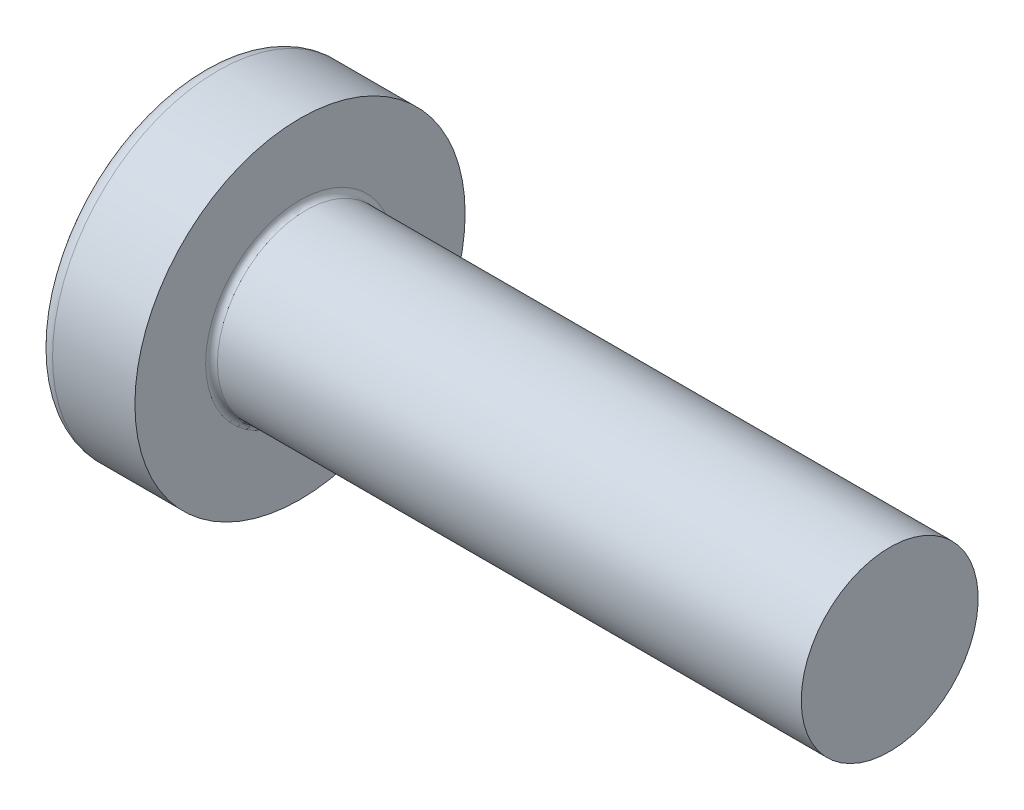
ISO-10303-21;
HEADER;
FILE_DESCRIPTION(('STEP AP214'),'2;1');
FILE_NAME('part.step','',(''),(''),'','','');
FILE_SCHEMA(('AUTOMOTIVE_DESIGN { 1 0 10303 214 1 1 1 1 }'));
ENDSEC;
DATA;
#1=APPLICATION_CONTEXT('core data for automotive mechanical design processes');
#2=APPLICATION_PROTOCOL_DEFINITION('international standard','automotive_design',2000,#1);
#3=PRODUCT_CONTEXT('',#1,'mechanical');
#4=PRODUCT('Part','Part','',(#3));
#5=PRODUCT_RELATED_PRODUCT_CATEGORY('part','',(#4));
#6=PRODUCT_DEFINITION_FORMATION('','',#4);
#7=PRODUCT_DEFINITION_CONTEXT('part definition',#1,'design');
#8=PRODUCT_DEFINITION('design','',#6,#7);
#9=PRODUCT_DEFINITION_SHAPE('','',#8);
#10=(LENGTH_UNIT() NAMED_UNIT(*) SI_UNIT(.MILLI.,.METRE.));
#11=(NAMED_UNIT(*) PLANE_ANGLE_UNIT() SI_UNIT($,.RADIAN.));
#12=(NAMED_UNIT(*) SI_UNIT($,.STERADIAN.) SOLID_ANGLE_UNIT());
#13=UNCERTAINTY_MEASURE_WITH_UNIT(LENGTH_MEASURE(1.E-05),#10,'distance_accuracy_value','');
#14=(GEOMETRIC_REPRESENTATION_CONTEXT(3) GLOBAL_UNCERTAINTY_ASSIGNED_CONTEXT((#13)) GLOBAL_UNIT_ASSIGNED_CONTEXT((#10,
#11,#12)) REPRESENTATION_CONTEXT('',''));
#15=CARTESIAN_POINT('',(0.,0.,0.));
#16=DIRECTION('',(0.,0.,1.));
#17=DIRECTION('',(1.,0.,0.));
#18=AXIS2_PLACEMENT_3D('',#15,#16,#17);
#19=CARTESIAN_POINT('',(5.,0.,0.));
#20=DIRECTION('',(-1.,0.,0.));
#21=DIRECTION('',(0.,1.,0.));
#22=AXIS2_PLACEMENT_3D('',#19,#20,#21);
#23=SPHERICAL_SURFACE('',#22,5.);
#24=CARTESIAN_POINT('',(0.775371598933733,0.,0.));
#25=DIRECTION('',(-1.,0.,0.));
#26=DIRECTION('',(0.,0.,1.));
#27=AXIS2_PLACEMENT_3D('',#24,#25,#26);
#28=CIRCLE('',#27,2.67441860465116);
#29=CARTESIAN_POINT('',(0.775371598933733,0.,2.67441860465116));
#30=VERTEX_POINT('',#29);
#31=EDGE_CURVE('E239',#30,#30,#28,.T.);
#32=ORIENTED_EDGE('',*,*,#31,.T.);
#33=EDGE_LOOP('',(#32));
#34=FACE_BOUND('',#33,.T.);
#35=CARTESIAN_POINT('',(0.0457951200896417,0.,0.));
#36=DIRECTION('',(1.,0.,0.));
#37=DIRECTION('',(0.,0.,-1.));
#38=AXIS2_PLACEMENT_3D('',#35,#36,#37);
#39=CIRCLE('',#38,0.675169614150692);
#40=CARTESIAN_POINT('',(0.0457951200896426,-0.369999999999998,-0.564760133040918));
#41=VERTEX_POINT('',#40);
#42=CARTESIAN_POINT('',(0.0457951200896417,-0.564760133040916,-0.37));
#43=VERTEX_POINT('',#42);
#44=EDGE_CURVE('E375',#41,#43,#39,.F.);
#45=ORIENTED_EDGE('',*,*,#44,.F.);
#46=CARTESIAN_POINT('',(5.,-0.37,0.));
#47=DIRECTION('',(0.,1.,0.));
#48=DIRECTION('',(0.,0.,1.));
#49=AXIS2_PLACEMENT_3D('',#46,#47,#48);
#50=CIRCLE('',#49,4.98629120689917);
#51=CARTESIAN_POINT('',(0.187869734228639,-0.369999999999995,-1.30633162146802));
#52=VERTEX_POINT('',#51);
#53=EDGE_CURVE('E301',#52,#41,#50,.T.);
#54=ORIENTED_EDGE('',*,*,#53,.F.);
#55=CARTESIAN_POINT('',(4.56358262530798,0.,0.875317983305919));
#56=DIRECTION('',(0.446197753347436,0.,-0.894934391398443));
#57=DIRECTION('',(-0.894934391398443,0.,-0.446197753347436));
#58=AXIS2_PLACEMENT_3D('',#55,#56,#57);
#59=CIRCLE('',#58,4.90340272700175);
#60=CARTESIAN_POINT('',(0.18786973422864,0.370000000000005,-1.30633162146802));
#61=VERTEX_POINT('',#60);
#62=EDGE_CURVE('E273',#52,#61,#59,.T.);
#63=ORIENTED_EDGE('',*,*,#62,.T.);
#64=CARTESIAN_POINT('',(5.,0.37,0.));
#65=DIRECTION('',(0.,-1.,0.));
#66=DIRECTION('',(0.,0.,-1.));
#67=AXIS2_PLACEMENT_3D('',#64,#65,#66);
#68=CIRCLE('',#67,4.98629120689917);
#69=CARTESIAN_POINT('',(0.0457951200896425,0.370000000000002,-0.564760133040916));
#70=VERTEX_POINT('',#69);
#71=EDGE_CURVE('E328',#70,#61,#68,.T.);
#72=ORIENTED_EDGE('',*,*,#71,.F.);
#73=CARTESIAN_POINT('',(0.0457951200896417,0.564760133040915,-0.37));
#74=VERTEX_POINT('',#73);
#75=EDGE_CURVE('E394',#74,#70,#39,.F.);
#76=ORIENTED_EDGE('',*,*,#75,.F.);
#77=CARTESIAN_POINT('',(5.,0.,-0.37));
#78=DIRECTION('',(0.,0.,1.));
#79=DIRECTION('',(1.,0.,0.));
#80=AXIS2_PLACEMENT_3D('',#77,#78,#79);
#81=CIRCLE('',#80,4.98629120689917);
#82=CARTESIAN_POINT('',(0.187869734228641,1.30633162146802,-0.37));
#83=VERTEX_POINT('',#82);
#84=EDGE_CURVE('E267',#83,#74,#81,.T.);
#85=ORIENTED_EDGE('',*,*,#84,.F.);
#86=CARTESIAN_POINT('',(4.56358262530798,-0.87531798330592,0.));
#87=DIRECTION('',(0.446197753347436,0.894934391398443,0.));
#88=DIRECTION('',(-0.894934391398442,0.446197753347436,0.));
#89=AXIS2_PLACEMENT_3D('',#86,#87,#88);
#90=CIRCLE('',#89,4.90340272700175);
#91=CARTESIAN_POINT('',(0.18786973422864,1.30633162146802,0.37));
#92=VERTEX_POINT('',#91);
#93=EDGE_CURVE('E270',#83,#92,#90,.T.);
#94=ORIENTED_EDGE('',*,*,#93,.T.);
#95=CARTESIAN_POINT('',(5.,0.,0.37));
#96=DIRECTION('',(0.,0.,-1.));
#97=DIRECTION('',(0.,1.,0.));
#98=AXIS2_PLACEMENT_3D('',#95,#96,#97);
#99=CIRCLE('',#98,4.98629120689917);
#100=CARTESIAN_POINT('',(0.0457951200896417,0.564760133040915,0.37));
#101=VERTEX_POINT('',#100);
#102=EDGE_CURVE('E263',#101,#92,#99,.T.);
#103=ORIENTED_EDGE('',*,*,#102,.F.);
#104=CARTESIAN_POINT('',(0.0457951200896434,0.369999999999998,0.564760133040918));
#105=VERTEX_POINT('',#104);
#106=EDGE_CURVE('E393',#105,#101,#39,.F.);
#107=ORIENTED_EDGE('',*,*,#106,.F.);
#108=CARTESIAN_POINT('',(0.18786973422864,0.369999999999995,1.30633162146802));
#109=VERTEX_POINT('',#108);
#110=EDGE_CURVE('E283',#109,#105,#68,.T.);
#111=ORIENTED_EDGE('',*,*,#110,.F.);
#112=CARTESIAN_POINT('',(4.56358262530798,0.,-0.87531798330592));
#113=DIRECTION('',(0.446197753347436,0.,0.894934391398443));
#114=DIRECTION('',(0.894934391398442,0.,-0.446197753347436));
#115=AXIS2_PLACEMENT_3D('',#112,#113,#114);
#116=CIRCLE('',#115,4.90340272700175);
#117=CARTESIAN_POINT('',(0.18786973422864,-0.370000000000005,1.30633162146802));
#118=VERTEX_POINT('',#117);
#119=EDGE_CURVE('E50',#109,#118,#116,.T.);
#120=ORIENTED_EDGE('',*,*,#119,.T.);
#121=CARTESIAN_POINT('',(0.0457951200896421,-0.370000000000002,0.564760133040916));
#122=VERTEX_POINT('',#121);
#123=EDGE_CURVE('E280',#122,#118,#50,.T.);
#124=ORIENTED_EDGE('',*,*,#123,.F.);
#125=CARTESIAN_POINT('',(0.0457951200896417,-0.564760133040916,0.37));
#126=VERTEX_POINT('',#125);
#127=EDGE_CURVE('E433',#126,#122,#39,.F.);
#128=ORIENTED_EDGE('',*,*,#127,.F.);
#129=CARTESIAN_POINT('',(0.187869734228639,-1.30633162146802,0.37));
#130=VERTEX_POINT('',#129);
#131=EDGE_CURVE('E264',#130,#126,#99,.T.);
#132=ORIENTED_EDGE('',*,*,#131,.F.);
#133=CARTESIAN_POINT('',(4.56358262530798,0.875317983305919,0.));
#134=DIRECTION('',(0.446197753347436,-0.894934391398443,0.));
#135=DIRECTION('',(0.894934391398443,0.446197753347436,0.));
#136=AXIS2_PLACEMENT_3D('',#133,#134,#135);
#137=CIRCLE('',#136,4.90340272700175);
#138=CARTESIAN_POINT('',(0.18786973422864,-1.30633162146802,-0.37));
#139=VERTEX_POINT('',#138);
#140=EDGE_CURVE('E260',#130,#139,#137,.T.);
#141=ORIENTED_EDGE('',*,*,#140,.T.);
#142=EDGE_CURVE('E65',#43,#139,#81,.T.);
#143=ORIENTED_EDGE('',*,*,#142,.F.);
#144=EDGE_LOOP('',(#45,#54,#63,#72,#76,#85,#94,#103,#107,#111,#120,#124,#128,#132,#141,#143));
#145=FACE_BOUND('',#144,.T.);
#146=ADVANCED_FACE('F36',(#34,#145),#23,.T.);
#147=CARTESIAN_POINT('',(1.75,0.527482331818931,-0.37));
#148=DIRECTION('',(0.,0.,1.));
#149=DIRECTION('',(1.,0.,0.));
#150=AXIS2_PLACEMENT_3D('',#147,#148,#149);
#151=PLANE('',#150);
#152=ORIENTED_EDGE('',*,*,#84,.T.);
#153=CARTESIAN_POINT('',(-0.987293237053716,0.649401255967161,-0.37));
#154=CARTESIAN_POINT('',(-0.781914975317084,0.632865887002871,-0.37));
#155=CARTESIAN_POINT('',(-0.576547882393372,0.616188977635081,-0.37));
#156=CARTESIAN_POINT('',(-0.165841599226327,0.582441031964227,-0.37));
#157=CARTESIAN_POINT('',(0.0394975903090452,0.56536998705488,-0.37));
#158=CARTESIAN_POINT('',(0.450133475422572,0.530723441326535,-0.37));
#159=CARTESIAN_POINT('',(0.655430171010573,0.513147940624557,-0.37));
#160=CARTESIAN_POINT('',(1.06596140177934,0.477314957985794,-0.37));
#161=CARTESIAN_POINT('',(1.2711959378071,0.459057485806066,-0.37));
#162=CARTESIAN_POINT('',(1.61065292365626,0.428051938688768,-0.37));
#163=CARTESIAN_POINT('',(1.74490059995643,0.415580824990931,-0.37));
#164=CARTESIAN_POINT('',(2.01334321762763,0.390092023404979,-0.37));
#165=CARTESIAN_POINT('',(2.14753815934577,0.377074339177353,-0.37));
#166=CARTESIAN_POINT('',(2.41586354151957,0.350315629452843,-0.37));
#167=CARTESIAN_POINT('',(2.5499939784531,0.33657456817765,-0.37));
#168=CARTESIAN_POINT('',(2.81814173295471,0.308004077741875,-0.37));
#169=CARTESIAN_POINT('',(2.95215904765134,0.293174621747065,-0.37));
#170=CARTESIAN_POINT('',(3.0860955068368,0.277618485071816,-0.37));
#171=B_SPLINE_CURVE_WITH_KNOTS('',3,(#153,#154,#155,#156,#157,#158,#159,#160,#161,#162,#163,
#164,#165,#166,#167,#168,#169,#170),.UNSPECIFIED.,.F.,.F.,(4,2,2,2,2,2,2,2,4),(0.,
0.618128793984691,1.23627109812525,1.85441325887562,2.4725465791681,2.87702276218609,
3.28149623678161,3.68598973550942,4.09049321032311),.UNSPECIFIED.);
#172=CARTESIAN_POINT('',(1.75,0.415013252800437,-0.370000000000001));
#173=VERTEX_POINT('',#172);
#174=EDGE_CURVE('E417',#74,#173,#171,.T.);
#175=ORIENTED_EDGE('',*,*,#174,.T.);
#176=DIRECTION('',(0.,1.,0.));
#177=VECTOR('',#176,1.);
#178=CARTESIAN_POINT('',(1.75,-0.527482331818931,-0.37));
#179=LINE('',#178,#177);
#180=CARTESIAN_POINT('',(1.75,0.527482331818931,-0.37));
#181=VERTEX_POINT('',#180);
#182=EDGE_CURVE('E357',#173,#181,#179,.T.);
#183=ORIENTED_EDGE('',*,*,#182,.T.);
#184=DIRECTION('',(0.894934391398442,-0.446197753347436,0.));
#185=VECTOR('',#184,1.);
#186=CARTESIAN_POINT('',(0.,1.4,-0.37));
#187=LINE('',#186,#185);
#188=EDGE_CURVE('E240',#83,#181,#187,.T.);
#189=ORIENTED_EDGE('',*,*,#188,.F.);
#190=EDGE_LOOP('',(#152,#175,#183,#189));
#191=FACE_BOUND('',#190,.T.);
#192=ADVANCED_FACE('F195',(#191),#151,.T.);
#193=CARTESIAN_POINT('',(1.75,-0.527482331818931,-0.37));
#194=VERTEX_POINT('',#193);
#195=CARTESIAN_POINT('',(1.75,-0.415013252800437,-0.370000000000001));
#196=VERTEX_POINT('',#195);
#197=EDGE_CURVE('E248',#194,#196,#179,.T.);
#198=ORIENTED_EDGE('',*,*,#197,.T.);
#199=CARTESIAN_POINT('',(-0.987293237053716,-0.649401255967161,-0.37));
#200=CARTESIAN_POINT('',(-0.781914975317084,-0.632865887002871,-0.37));
#201=CARTESIAN_POINT('',(-0.576547882393372,-0.616188977635081,-0.37));
#202=CARTESIAN_POINT('',(-0.165841599226327,-0.582441031964227,-0.37));
#203=CARTESIAN_POINT('',(0.0394975903090452,-0.56536998705488,-0.37));
#204=CARTESIAN_POINT('',(0.450133475422572,-0.530723441326535,-0.37));
#205=CARTESIAN_POINT('',(0.655430171010573,-0.513147940624557,-0.37));
#206=CARTESIAN_POINT('',(1.06596140177934,-0.477314957985794,-0.37));
#207=CARTESIAN_POINT('',(1.2711959378071,-0.459057485806066,-0.37));
#208=CARTESIAN_POINT('',(1.61065292365626,-0.428051938688768,-0.37));
#209=CARTESIAN_POINT('',(1.74490059995643,-0.415580824990931,-0.37));
#210=CARTESIAN_POINT('',(2.01334321762763,-0.390092023404979,-0.37));
#211=CARTESIAN_POINT('',(2.14753815934577,-0.377074339177353,-0.37));
#212=CARTESIAN_POINT('',(2.41586354151957,-0.350315629452843,-0.37));
#213=CARTESIAN_POINT('',(2.5499939784531,-0.33657456817765,-0.37));
#214=CARTESIAN_POINT('',(2.81814173295471,-0.308004077741875,-0.37));
#215=CARTESIAN_POINT('',(2.95215904765134,-0.293174621747065,-0.37));
#216=CARTESIAN_POINT('',(3.0860955068368,-0.277618485071816,-0.37));
#217=B_SPLINE_CURVE_WITH_KNOTS('',3,(#199,#200,#201,#202,#203,#204,#205,#206,#207,#208,#209,
#210,#211,#212,#213,#214,#215,#216),.UNSPECIFIED.,.F.,.F.,(4,2,2,2,2,2,2,2,4),(0.,
0.618128793984691,1.23627109812525,1.85441325887562,2.4725465791681,2.87702276218609,
3.28149623678161,3.68598973550942,4.09049321032311),.UNSPECIFIED.);
#218=EDGE_CURVE('E392',#196,#43,#217,.F.);
#219=ORIENTED_EDGE('',*,*,#218,.T.);
#220=ORIENTED_EDGE('',*,*,#142,.T.);
#221=DIRECTION('',(0.894934391398442,0.446197753347436,0.));
#222=VECTOR('',#221,1.);
#223=CARTESIAN_POINT('',(0.,-1.4,-0.37));
#224=LINE('',#223,#222);
#225=EDGE_CURVE('E331',#139,#194,#224,.T.);
#226=ORIENTED_EDGE('',*,*,#225,.T.);
#227=EDGE_LOOP('',(#198,#219,#220,#226));
#228=FACE_BOUND('',#227,.T.);
#229=ADVANCED_FACE('F201',(#228),#151,.T.);
#230=CARTESIAN_POINT('',(1.75,-0.527482331818931,0.37));
#231=DIRECTION('',(0.,0.,-1.));
#232=DIRECTION('',(0.,1.,0.));
#233=AXIS2_PLACEMENT_3D('',#230,#231,#232);
#234=PLANE('',#233);
#235=DIRECTION('',(0.,-1.,0.));
#236=VECTOR('',#235,1.);
#237=CARTESIAN_POINT('',(1.75,0.527482331818931,0.37));
#238=LINE('',#237,#236);
#239=CARTESIAN_POINT('',(1.75,0.527482331818931,0.37));
#240=VERTEX_POINT('',#239);
#241=CARTESIAN_POINT('',(1.75,0.415013252800437,0.370000000000001));
#242=VERTEX_POINT('',#241);
#243=EDGE_CURVE('E340',#240,#242,#238,.T.);
#244=ORIENTED_EDGE('',*,*,#243,.T.);
#245=CARTESIAN_POINT('',(-0.987293237053716,0.649401255967161,0.37));
#246=CARTESIAN_POINT('',(-0.781914975317084,0.632865887002871,0.37));
#247=CARTESIAN_POINT('',(-0.576547882393372,0.616188977635081,0.37));
#248=CARTESIAN_POINT('',(-0.165841599226327,0.582441031964227,0.37));
#249=CARTESIAN_POINT('',(0.0394975903090453,0.56536998705488,0.37));
#250=CARTESIAN_POINT('',(0.450133475422572,0.530723441326535,0.37));
#251=CARTESIAN_POINT('',(0.655430171010574,0.513147940624557,0.37));
#252=CARTESIAN_POINT('',(1.06596140177934,0.477314957985794,0.37));
#253=CARTESIAN_POINT('',(1.2711959378071,0.459057485806066,0.37));
#254=CARTESIAN_POINT('',(1.61065292365626,0.428051938688768,0.37));
#255=CARTESIAN_POINT('',(1.74490059995643,0.415580824990931,0.37));
#256=CARTESIAN_POINT('',(2.01334321762763,0.39009202340498,0.37));
#257=CARTESIAN_POINT('',(2.14753815934577,0.377074339177353,0.37));
#258=CARTESIAN_POINT('',(2.41586354151957,0.350315629452843,0.37));
#259=CARTESIAN_POINT('',(2.5499939784531,0.33657456817765,0.37));
#260=CARTESIAN_POINT('',(2.81814173295471,0.308004077741875,0.37));
#261=CARTESIAN_POINT('',(2.95215904765134,0.293174621747065,0.37));
#262=CARTESIAN_POINT('',(3.0860955068368,0.277618485071816,0.37));
#263=B_SPLINE_CURVE_WITH_KNOTS('',3,(#245,#246,#247,#248,#249,#250,#251,#252,#253,#254,#255,
#256,#257,#258,#259,#260,#261,#262),.UNSPECIFIED.,.F.,.F.,(4,2,2,2,2,2,2,2,4),(0.,
0.618128793984691,1.23627109812525,1.85441325887562,2.4725465791681,2.87702276218609,
3.28149623678161,3.68598973550942,4.09049321032311),.UNSPECIFIED.);
#264=EDGE_CURVE('E672',#242,#101,#263,.F.);
#265=ORIENTED_EDGE('',*,*,#264,.T.);
#266=ORIENTED_EDGE('',*,*,#102,.T.);
#267=DIRECTION('',(0.894934391398442,-0.446197753347436,0.));
#268=VECTOR('',#267,1.);
#269=CARTESIAN_POINT('',(0.,1.4,0.37));
#270=LINE('',#269,#268);
#271=EDGE_CURVE('E245',#92,#240,#270,.T.);
#272=ORIENTED_EDGE('',*,*,#271,.T.);
#273=EDGE_LOOP('',(#244,#265,#266,#272));
#274=FACE_BOUND('',#273,.T.);
#275=ADVANCED_FACE('F413',(#274),#234,.T.);
#276=ORIENTED_EDGE('',*,*,#131,.T.);
#277=CARTESIAN_POINT('',(-0.987293237069635,-0.649401255968442,0.37));
#278=CARTESIAN_POINT('',(-0.781914975331301,-0.632865887004023,0.37));
#279=CARTESIAN_POINT('',(-0.576547882405888,-0.616188977636102,0.37));
#280=CARTESIAN_POINT('',(-0.16584159923544,-0.582441031964983,0.37));
#281=CARTESIAN_POINT('',(0.0394975903016338,-0.5653699870555,0.37));
#282=CARTESIAN_POINT('',(0.450133475420601,-0.530723441326706,0.37));
#283=CARTESIAN_POINT('',(0.655430171012341,-0.513147940624409,0.37));
#284=CARTESIAN_POINT('',(1.06596140178858,-0.477314957984981,0.37));
#285=CARTESIAN_POINT('',(1.27119593782008,-0.459057485804908,0.37));
#286=CARTESIAN_POINT('',(1.61065292367297,-0.428051938687225,0.37));
#287=CARTESIAN_POINT('',(1.74490059997313,-0.415580824989368,0.37));
#288=CARTESIAN_POINT('',(2.01334321764434,-0.390092023403371,0.37));
#289=CARTESIAN_POINT('',(2.14753815936247,-0.377074339175718,0.37));
#290=CARTESIAN_POINT('',(2.41586354153627,-0.350315629451146,0.37));
#291=CARTESIAN_POINT('',(2.54999397846979,-0.336574568175918,0.37));
#292=CARTESIAN_POINT('',(2.8181417329714,-0.308004077740054,0.37));
#293=CARTESIAN_POINT('',(2.95215904766802,-0.29317462174519,0.37));
#294=CARTESIAN_POINT('',(3.08609550685347,-0.277618485069873,0.37));
#295=B_SPLINE_CURVE_WITH_KNOTS('',3,(#277,#278,#279,#280,#281,#282,#283,#284,#285,#286,#287,
#288,#289,#290,#291,#292,#293,#294),.UNSPECIFIED.,.F.,.F.,(4,2,2,2,2,2,2,2,4),(0.,
0.61812879398981,1.23627109813549,1.85441325889711,2.47254657920086,2.87702276221884,
3.28149623681437,3.68598973554218,4.09049321035586),.UNSPECIFIED.);
#296=CARTESIAN_POINT('',(1.75,-0.415013252800437,0.37));
#297=VERTEX_POINT('',#296);
#298=EDGE_CURVE('E434',#126,#297,#295,.T.);
#299=ORIENTED_EDGE('',*,*,#298,.T.);
#300=CARTESIAN_POINT('',(1.75,-0.527482331818932,0.37));
#301=VERTEX_POINT('',#300);
#302=EDGE_CURVE('E342',#297,#301,#238,.T.);
#303=ORIENTED_EDGE('',*,*,#302,.T.);
#304=DIRECTION('',(0.894934391398443,0.446197753347436,0.));
#305=VECTOR('',#304,1.);
#306=CARTESIAN_POINT('',(0.,-1.4,0.37));
#307=LINE('',#306,#305);
#308=EDGE_CURVE('E333',#130,#301,#307,.T.);
#309=ORIENTED_EDGE('',*,*,#308,.F.);
#310=EDGE_LOOP('',(#276,#299,#303,#309));
#311=FACE_BOUND('',#310,.T.);
#312=ADVANCED_FACE('F520',(#311),#234,.T.);
#313=CARTESIAN_POINT('',(1.75,0.527482331818931,0.37));
#314=DIRECTION('',(0.446197753347436,0.894934391398443,0.));
#315=DIRECTION('',(-0.894934391398442,0.446197753347436,0.));
#316=AXIS2_PLACEMENT_3D('',#313,#314,#315);
#317=PLANE('',#316);
#318=CARTESIAN_POINT('',(2.6696526882832,0.0689604923233249,0.));
#319=DIRECTION('',(0.446197753347436,0.894934391398443,0.));
#320=DIRECTION('',(-0.894934391398443,0.446197753347436,0.));
#321=AXIS2_PLACEMENT_3D('',#318,#319,#320);
#322=ELLIPSE('',#321,1.10195897609154,0.486831694838766);
#323=CARTESIAN_POINT('',(1.75,0.527482331818932,0.175779377683682));
#324=VERTEX_POINT('',#323);
#325=CARTESIAN_POINT('',(1.75,0.527482331818932,-0.175779377683682));
#326=VERTEX_POINT('',#325);
#327=EDGE_CURVE('E306',#324,#326,#322,.F.);
#328=ORIENTED_EDGE('',*,*,#327,.F.);
#329=DIRECTION('',(0.,0.,-1.));
#330=VECTOR('',#329,1.);
#331=CARTESIAN_POINT('',(1.75,0.527482331818931,0.37));
#332=LINE('',#331,#330);
#333=EDGE_CURVE('E343',#240,#324,#332,.T.);
#334=ORIENTED_EDGE('',*,*,#333,.F.);
#335=ORIENTED_EDGE('',*,*,#271,.F.);
#336=ORIENTED_EDGE('',*,*,#93,.F.);
#337=ORIENTED_EDGE('',*,*,#188,.T.);
#338=EDGE_CURVE('E345',#326,#181,#332,.T.);
#339=ORIENTED_EDGE('',*,*,#338,.F.);
#340=EDGE_LOOP('',(#328,#334,#335,#336,#337,#339));
#341=FACE_BOUND('',#340,.T.);
#342=ADVANCED_FACE('F411',(#341),#317,.F.);
#343=CARTESIAN_POINT('',(0.,-1.4,-0.37));
#344=DIRECTION('',(0.446197753347436,-0.894934391398443,0.));
#345=DIRECTION('',(0.894934391398443,0.446197753347436,0.));
#346=AXIS2_PLACEMENT_3D('',#343,#344,#345);
#347=PLANE('',#346);
#348=CARTESIAN_POINT('',(2.6696526882832,-0.0689604923233252,0.));
#349=DIRECTION('',(0.446197753347436,-0.894934391398443,0.));
#350=DIRECTION('',(-0.894934391398443,-0.446197753347436,0.));
#351=AXIS2_PLACEMENT_3D('',#348,#349,#350);
#352=ELLIPSE('',#351,1.10195897609154,0.486831694838766);
#353=CARTESIAN_POINT('',(1.75,-0.527482331818932,-0.175779377683681));
#354=VERTEX_POINT('',#353);
#355=CARTESIAN_POINT('',(1.75,-0.527482331818932,0.17577937768368));
#356=VERTEX_POINT('',#355);
#357=EDGE_CURVE('E674',#354,#356,#352,.F.);
#358=ORIENTED_EDGE('',*,*,#357,.F.);
#359=DIRECTION('',(0.,0.,1.));
#360=VECTOR('',#359,1.);
#361=CARTESIAN_POINT('',(1.75,-0.527482331818931,-0.37));
#362=LINE('',#361,#360);
#363=EDGE_CURVE('E336',#194,#354,#362,.T.);
#364=ORIENTED_EDGE('',*,*,#363,.F.);
#365=ORIENTED_EDGE('',*,*,#225,.F.);
#366=ORIENTED_EDGE('',*,*,#140,.F.);
#367=ORIENTED_EDGE('',*,*,#308,.T.);
#368=EDGE_CURVE('E339',#356,#301,#362,.T.);
#369=ORIENTED_EDGE('',*,*,#368,.F.);
#370=EDGE_LOOP('',(#358,#364,#365,#366,#367,#369));
#371=FACE_BOUND('',#370,.T.);
#372=ADVANCED_FACE('F507',(#371),#347,.F.);
#373=CARTESIAN_POINT('',(1.75,0.527482331818931,-0.37));
#374=DIRECTION('',(-1.,0.,0.));
#375=DIRECTION('',(0.,0.,1.));
#376=AXIS2_PLACEMENT_3D('',#373,#374,#375);
#377=PLANE('',#376);
#378=DIRECTION('',(0.,1.,0.));
#379=VECTOR('',#378,1.);
#380=CARTESIAN_POINT('',(1.75,-0.370000000000002,0.52748233181893));
#381=LINE('',#380,#379);
#382=CARTESIAN_POINT('',(1.75,-0.370000000000002,0.52748233181893));
#383=VERTEX_POINT('',#382);
#384=CARTESIAN_POINT('',(1.75,-0.175779377683686,0.52748233181893));
#385=VERTEX_POINT('',#384);
#386=EDGE_CURVE('E321',#383,#385,#381,.T.);
#387=ORIENTED_EDGE('',*,*,#386,.T.);
#388=CARTESIAN_POINT('',(1.75,0.,0.));
#389=DIRECTION('',(-1.,0.,0.));
#390=DIRECTION('',(0.,0.,1.));
#391=AXIS2_PLACEMENT_3D('',#388,#389,#390);
#392=CIRCLE('',#391,0.556);
#393=CARTESIAN_POINT('',(1.75,-0.370000000000001,0.415013252800436));
#394=VERTEX_POINT('',#393);
#395=EDGE_CURVE('E702',#394,#385,#392,.T.);
#396=ORIENTED_EDGE('',*,*,#395,.F.);
#397=DIRECTION('',(0.,0.,-1.));
#398=VECTOR('',#397,1.);
#399=CARTESIAN_POINT('',(1.75,-0.370000000000002,0.52748233181893));
#400=LINE('',#399,#398);
#401=EDGE_CURVE('E317',#383,#394,#400,.T.);
#402=ORIENTED_EDGE('',*,*,#401,.F.);
#403=EDGE_LOOP('',(#387,#396,#402));
#404=FACE_BOUND('',#403,.T.);
#405=ADVANCED_FACE('F500',(#404),#377,.T.);
#406=ORIENTED_EDGE('',*,*,#302,.F.);
#407=EDGE_CURVE('E707',#356,#297,#392,.T.);
#408=ORIENTED_EDGE('',*,*,#407,.F.);
#409=ORIENTED_EDGE('',*,*,#368,.T.);
#410=EDGE_LOOP('',(#406,#408,#409));
#411=FACE_BOUND('',#410,.T.);
#412=ADVANCED_FACE('F493',(#411),#377,.T.);
#413=ORIENTED_EDGE('',*,*,#363,.T.);
#414=EDGE_CURVE('E386',#196,#354,#392,.T.);
#415=ORIENTED_EDGE('',*,*,#414,.F.);
#416=ORIENTED_EDGE('',*,*,#197,.F.);
#417=EDGE_LOOP('',(#413,#415,#416));
#418=FACE_BOUND('',#417,.T.);
#419=ADVANCED_FACE('F487',(#418),#377,.T.);
#420=CARTESIAN_POINT('',(1.75,-0.369999999999998,-0.415013252800438));
#421=VERTEX_POINT('',#420);
#422=CARTESIAN_POINT('',(1.75,-0.369999999999998,-0.527482331818933));
#423=VERTEX_POINT('',#422);
#424=EDGE_CURVE('E320',#421,#423,#400,.T.);
#425=ORIENTED_EDGE('',*,*,#424,.F.);
#426=CARTESIAN_POINT('',(1.75,-0.17577937768368,-0.527482331818932));
#427=VERTEX_POINT('',#426);
#428=EDGE_CURVE('E57',#427,#421,#392,.T.);
#429=ORIENTED_EDGE('',*,*,#428,.F.);
#430=DIRECTION('',(0.,-1.,0.));
#431=VECTOR('',#430,1.);
#432=CARTESIAN_POINT('',(1.75,0.370000000000002,-0.52748233181893));
#433=LINE('',#432,#431);
#434=EDGE_CURVE('E316',#427,#423,#433,.T.);
#435=ORIENTED_EDGE('',*,*,#434,.T.);
#436=EDGE_LOOP('',(#425,#429,#435));
#437=FACE_BOUND('',#436,.T.);
#438=ADVANCED_FACE('F381',(#437),#377,.T.);
#439=CARTESIAN_POINT('',(1.75,0.370000000000002,-0.52748233181893));
#440=VERTEX_POINT('',#439);
#441=CARTESIAN_POINT('',(1.75,0.175779377683684,-0.527482331818931));
#442=VERTEX_POINT('',#441);
#443=EDGE_CURVE('E313',#440,#442,#433,.T.);
#444=ORIENTED_EDGE('',*,*,#443,.T.);
#445=CARTESIAN_POINT('',(1.75,0.370000000000001,-0.415013252800436));
#446=VERTEX_POINT('',#445);
#447=EDGE_CURVE('E385',#446,#442,#392,.T.);
#448=ORIENTED_EDGE('',*,*,#447,.F.);
#449=DIRECTION('',(0.,0.,1.));
#450=VECTOR('',#449,1.);
#451=CARTESIAN_POINT('',(1.75,0.370000000000002,-0.52748233181893));
#452=LINE('',#451,#450);
#453=EDGE_CURVE('E325',#440,#446,#452,.T.);
#454=ORIENTED_EDGE('',*,*,#453,.F.);
#455=EDGE_LOOP('',(#444,#448,#454));
#456=FACE_BOUND('',#455,.T.);
#457=ADVANCED_FACE('F475',(#456),#377,.T.);
#458=ORIENTED_EDGE('',*,*,#182,.F.);
#459=EDGE_CURVE('E691',#326,#173,#392,.T.);
#460=ORIENTED_EDGE('',*,*,#459,.F.);
#461=ORIENTED_EDGE('',*,*,#338,.T.);
#462=EDGE_LOOP('',(#458,#460,#461));
#463=FACE_BOUND('',#462,.T.);
#464=ADVANCED_FACE('F468',(#463),#377,.T.);
#465=ORIENTED_EDGE('',*,*,#333,.T.);
#466=EDGE_CURVE('E693',#242,#324,#392,.T.);
#467=ORIENTED_EDGE('',*,*,#466,.F.);
#468=ORIENTED_EDGE('',*,*,#243,.F.);
#469=EDGE_LOOP('',(#465,#467,#468));
#470=FACE_BOUND('',#469,.T.);
#471=ADVANCED_FACE('F462',(#470),#377,.T.);
#472=CARTESIAN_POINT('',(1.75,0.369999999999998,0.527482331818932));
#473=DIRECTION('',(0.,-1.,0.));
#474=DIRECTION('',(1.,0.,0.));
#475=AXIS2_PLACEMENT_3D('',#472,#473,#474);
#476=PLANE('',#475);
#477=ORIENTED_EDGE('',*,*,#110,.T.);
#478=CARTESIAN_POINT('',(-0.987293237069635,0.369999999999998,0.649401255968443));
#479=CARTESIAN_POINT('',(-0.781914975331301,0.369999999999998,0.632865887004024));
#480=CARTESIAN_POINT('',(-0.576547882405888,0.369999999999998,0.616188977636103));
#481=CARTESIAN_POINT('',(-0.16584159923544,0.369999999999998,0.582441031964984));
#482=CARTESIAN_POINT('',(0.0394975903016338,0.369999999999998,0.565369987055501));
#483=CARTESIAN_POINT('',(0.450133475420601,0.369999999999998,0.530723441326707));
#484=CARTESIAN_POINT('',(0.655430171012341,0.369999999999998,0.51314794062441));
#485=CARTESIAN_POINT('',(1.06596140178858,0.369999999999998,0.477314957984982));
#486=CARTESIAN_POINT('',(1.27119593782008,0.369999999999998,0.459057485804909));
#487=CARTESIAN_POINT('',(1.61065292367297,0.369999999999999,0.428051938687226));
#488=CARTESIAN_POINT('',(1.74490059997313,0.369999999999999,0.415580824989369));
#489=CARTESIAN_POINT('',(2.01334321764434,0.369999999999999,0.390092023403372));
#490=CARTESIAN_POINT('',(2.14753815936247,0.369999999999999,0.37707433917572));
#491=CARTESIAN_POINT('',(2.41586354153627,0.369999999999999,0.350315629451147));
#492=CARTESIAN_POINT('',(2.54999397846979,0.369999999999999,0.336574568175919));
#493=CARTESIAN_POINT('',(2.8181417329714,0.369999999999999,0.308004077740055));
#494=CARTESIAN_POINT('',(2.95215904766802,0.369999999999999,0.293174621745191));
#495=CARTESIAN_POINT('',(3.08609550685347,0.369999999999999,0.277618485069875));
#496=B_SPLINE_CURVE_WITH_KNOTS('',3,(#478,#479,#480,#481,#482,#483,#484,#485,#486,#487,#488,
#489,#490,#491,#492,#493,#494,#495),.UNSPECIFIED.,.F.,.F.,(4,2,2,2,2,2,2,2,4),(0.,
0.61812879398981,1.23627109813549,1.85441325889711,2.47254657920086,2.87702276221884,
3.28149623681436,3.68598973554218,4.09049321035586),.UNSPECIFIED.);
#497=CARTESIAN_POINT('',(1.75,0.369999999999999,0.415013252800439));
#498=VERTEX_POINT('',#497);
#499=EDGE_CURVE('E671',#105,#498,#496,.T.);
#500=ORIENTED_EDGE('',*,*,#499,.T.);
#501=CARTESIAN_POINT('',(1.75,0.369999999999998,0.527482331818932));
#502=VERTEX_POINT('',#501);
#503=EDGE_CURVE('E298',#498,#502,#452,.T.);
#504=ORIENTED_EDGE('',*,*,#503,.T.);
#505=DIRECTION('',(0.894934391398442,0.,-0.446197753347436));
#506=VECTOR('',#505,1.);
#507=CARTESIAN_POINT('',(0.,0.369999999999995,1.4));
#508=LINE('',#507,#506);
#509=EDGE_CURVE('E291',#109,#502,#508,.T.);
#510=ORIENTED_EDGE('',*,*,#509,.F.);
#511=EDGE_LOOP('',(#477,#500,#504,#510));
#512=FACE_BOUND('',#511,.T.);
#513=ADVANCED_FACE('F295',(#512),#476,.T.);
#514=CARTESIAN_POINT('',(1.75,-0.369999999999998,-0.527482331818933));
#515=DIRECTION('',(0.,1.,0.));
#516=DIRECTION('',(0.,0.,1.));
#517=AXIS2_PLACEMENT_3D('',#514,#515,#516);
#518=PLANE('',#517);
#519=ORIENTED_EDGE('',*,*,#401,.T.);
#520=CARTESIAN_POINT('',(-0.987293237053716,-0.370000000000002,0.64940125596716));
#521=CARTESIAN_POINT('',(-0.781914975317084,-0.370000000000002,0.63286588700287));
#522=CARTESIAN_POINT('',(-0.576547882393372,-0.370000000000002,0.61618897763508));
#523=CARTESIAN_POINT('',(-0.165841599226327,-0.370000000000002,0.582441031964225));
#524=CARTESIAN_POINT('',(0.0394975903090451,-0.370000000000002,0.565369987054878));
#525=CARTESIAN_POINT('',(0.450133475422572,-0.370000000000002,0.530723441326533));
#526=CARTESIAN_POINT('',(0.655430171010573,-0.370000000000002,0.513147940624555));
#527=CARTESIAN_POINT('',(1.06596140177934,-0.370000000000002,0.477314957985793));
#528=CARTESIAN_POINT('',(1.2711959378071,-0.370000000000002,0.459057485806065));
#529=CARTESIAN_POINT('',(1.61065292365626,-0.370000000000001,0.428051938688767));
#530=CARTESIAN_POINT('',(1.74490059995642,-0.370000000000001,0.41558082499093));
#531=CARTESIAN_POINT('',(2.01334321762763,-0.370000000000001,0.390092023404978));
#532=CARTESIAN_POINT('',(2.14753815934577,-0.370000000000001,0.377074339177352));
#533=CARTESIAN_POINT('',(2.41586354151957,-0.370000000000001,0.350315629452841));
#534=CARTESIAN_POINT('',(2.5499939784531,-0.370000000000001,0.336574568177649));
#535=CARTESIAN_POINT('',(2.81814173295471,-0.370000000000001,0.308004077741874));
#536=CARTESIAN_POINT('',(2.95215904765134,-0.370000000000001,0.293174621747063));
#537=CARTESIAN_POINT('',(3.0860955068368,-0.370000000000001,0.277618485071814));
#538=B_SPLINE_CURVE_WITH_KNOTS('',3,(#520,#521,#522,#523,#524,#525,#526,#527,#528,#529,#530,
#531,#532,#533,#534,#535,#536,#537),.UNSPECIFIED.,.F.,.F.,(4,2,2,2,2,2,2,2,4),(0.,
0.618128793984691,1.23627109812525,1.85441325887562,2.4725465791681,2.87702276218609,
3.28149623678161,3.68598973550942,4.09049321032311),.UNSPECIFIED.);
#539=EDGE_CURVE('E426',#394,#122,#538,.F.);
#540=ORIENTED_EDGE('',*,*,#539,.T.);
#541=ORIENTED_EDGE('',*,*,#123,.T.);
#542=DIRECTION('',(0.894934391398442,0.,-0.446197753347436));
#543=VECTOR('',#542,1.);
#544=CARTESIAN_POINT('',(0.,-0.370000000000005,1.4));
#545=LINE('',#544,#543);
#546=EDGE_CURVE('E293',#118,#383,#545,.T.);
#547=ORIENTED_EDGE('',*,*,#546,.T.);
#548=EDGE_LOOP('',(#519,#540,#541,#547));
#549=FACE_BOUND('',#548,.T.);
#550=ADVANCED_FACE('F230',(#549),#518,.T.);
#551=CARTESIAN_POINT('',(1.75,-0.370000000000002,0.52748233181893));
#552=DIRECTION('',(0.446197753347436,0.,0.894934391398443));
#553=DIRECTION('',(-0.894934391398442,0.,0.446197753347436));
#554=AXIS2_PLACEMENT_3D('',#551,#552,#553);
#555=PLANE('',#554);
#556=CARTESIAN_POINT('',(2.6696526882832,0.,0.0689604923233248));
#557=DIRECTION('',(0.446197753347436,0.,0.894934391398443));
#558=DIRECTION('',(-0.894934391398443,0.,0.446197753347436));
#559=AXIS2_PLACEMENT_3D('',#556,#557,#558);
#560=ELLIPSE('',#559,1.10195897609154,0.486831694838766);
#561=CARTESIAN_POINT('',(1.75,0.175779377683682,0.527482331818932));
#562=VERTEX_POINT('',#561);
#563=EDGE_CURVE('E424',#385,#562,#560,.F.);
#564=ORIENTED_EDGE('',*,*,#563,.F.);
#565=ORIENTED_EDGE('',*,*,#386,.F.);
#566=ORIENTED_EDGE('',*,*,#546,.F.);
#567=ORIENTED_EDGE('',*,*,#119,.F.);
#568=ORIENTED_EDGE('',*,*,#509,.T.);
#569=EDGE_CURVE('E324',#562,#502,#381,.T.);
#570=ORIENTED_EDGE('',*,*,#569,.F.);
#571=EDGE_LOOP('',(#564,#565,#566,#567,#568,#570));
#572=FACE_BOUND('',#571,.T.);
#573=ADVANCED_FACE('F289',(#572),#555,.F.);
#574=CARTESIAN_POINT('',(0.,0.370000000000005,-1.4));
#575=DIRECTION('',(0.446197753347436,0.,-0.894934391398443));
#576=DIRECTION('',(0.894934391398443,0.,0.446197753347436));
#577=AXIS2_PLACEMENT_3D('',#574,#575,#576);
#578=PLANE('',#577);
#579=CARTESIAN_POINT('',(2.6696526882832,0.,-0.0689604923233253));
#580=DIRECTION('',(0.446197753347436,0.,-0.894934391398443));
#581=DIRECTION('',(-0.894934391398443,0.,-0.446197753347436));
#582=AXIS2_PLACEMENT_3D('',#579,#580,#581);
#583=ELLIPSE('',#582,1.10195897609154,0.486831694838766);
#584=EDGE_CURVE('E379',#442,#427,#583,.F.);
#585=ORIENTED_EDGE('',*,*,#584,.F.);
#586=ORIENTED_EDGE('',*,*,#443,.F.);
#587=DIRECTION('',(0.894934391398442,0.,0.446197753347436));
#588=VECTOR('',#587,1.);
#589=CARTESIAN_POINT('',(0.,0.370000000000005,-1.4));
#590=LINE('',#589,#588);
#591=EDGE_CURVE('E303',#61,#440,#590,.T.);
#592=ORIENTED_EDGE('',*,*,#591,.F.);
#593=ORIENTED_EDGE('',*,*,#62,.F.);
#594=DIRECTION('',(0.894934391398443,0.,0.446197753347436));
#595=VECTOR('',#594,1.);
#596=CARTESIAN_POINT('',(0.,-0.369999999999995,-1.4));
#597=LINE('',#596,#595);
#598=EDGE_CURVE('E310',#52,#423,#597,.T.);
#599=ORIENTED_EDGE('',*,*,#598,.T.);
#600=ORIENTED_EDGE('',*,*,#434,.F.);
#601=EDGE_LOOP('',(#585,#586,#592,#593,#599,#600));
#602=FACE_BOUND('',#601,.T.);
#603=ADVANCED_FACE('F370',(#602),#578,.F.);
#604=ORIENTED_EDGE('',*,*,#453,.T.);
#605=CARTESIAN_POINT('',(-0.987293237053716,0.370000000000002,-0.649401255967159));
#606=CARTESIAN_POINT('',(-0.781914975317084,0.370000000000002,-0.63286588700287));
#607=CARTESIAN_POINT('',(-0.576547882393372,0.370000000000002,-0.61618897763508));
#608=CARTESIAN_POINT('',(-0.165841599226327,0.370000000000002,-0.582441031964225));
#609=CARTESIAN_POINT('',(0.039497590309045,0.370000000000002,-0.565369987054878));
#610=CARTESIAN_POINT('',(0.450133475422572,0.370000000000002,-0.530723441326533));
#611=CARTESIAN_POINT('',(0.655430171010573,0.370000000000002,-0.513147940624555));
#612=CARTESIAN_POINT('',(1.06596140177934,0.370000000000002,-0.477314957985793));
#613=CARTESIAN_POINT('',(1.2711959378071,0.370000000000002,-0.459057485806065));
#614=CARTESIAN_POINT('',(1.61065292365626,0.370000000000001,-0.428051938688767));
#615=CARTESIAN_POINT('',(1.74490059995642,0.370000000000001,-0.41558082499093));
#616=CARTESIAN_POINT('',(2.01334321762763,0.370000000000001,-0.390092023404978));
#617=CARTESIAN_POINT('',(2.14753815934577,0.370000000000001,-0.377074339177352));
#618=CARTESIAN_POINT('',(2.41586354151957,0.370000000000001,-0.350315629452841));
#619=CARTESIAN_POINT('',(2.5499939784531,0.370000000000001,-0.336574568177649));
#620=CARTESIAN_POINT('',(2.81814173295471,0.370000000000001,-0.308004077741874));
#621=CARTESIAN_POINT('',(2.95215904765134,0.370000000000001,-0.293174621747064));
#622=CARTESIAN_POINT('',(3.0860955068368,0.370000000000001,-0.277618485071814));
#623=B_SPLINE_CURVE_WITH_KNOTS('',3,(#605,#606,#607,#608,#609,#610,#611,#612,#613,#614,#615,
#616,#617,#618,#619,#620,#621,#622),.UNSPECIFIED.,.F.,.F.,(4,2,2,2,2,2,2,2,4),(0.,
0.618128793984691,1.23627109812525,1.85441325887562,2.4725465791681,2.87702276218609,
3.28149623678161,3.68598973550942,4.09049321032311),.UNSPECIFIED.);
#624=EDGE_CURVE('E366',#446,#70,#623,.F.);
#625=ORIENTED_EDGE('',*,*,#624,.T.);
#626=ORIENTED_EDGE('',*,*,#71,.T.);
#627=ORIENTED_EDGE('',*,*,#591,.T.);
#628=EDGE_LOOP('',(#604,#625,#626,#627));
#629=FACE_BOUND('',#628,.T.);
#630=ADVANCED_FACE('F228',(#629),#476,.T.);
#631=ORIENTED_EDGE('',*,*,#53,.T.);
#632=CARTESIAN_POINT('',(-0.987293237069635,-0.369999999999997,-0.649401255968443));
#633=CARTESIAN_POINT('',(-0.781914975331301,-0.369999999999997,-0.632865887004025));
#634=CARTESIAN_POINT('',(-0.576547882405888,-0.369999999999997,-0.616188977636104));
#635=CARTESIAN_POINT('',(-0.16584159923544,-0.369999999999998,-0.582441031964984));
#636=CARTESIAN_POINT('',(0.0394975903016337,-0.369999999999998,-0.565369987055501));
#637=CARTESIAN_POINT('',(0.450133475420601,-0.369999999999998,-0.530723441326707));
#638=CARTESIAN_POINT('',(0.655430171012341,-0.369999999999998,-0.51314794062441));
#639=CARTESIAN_POINT('',(1.06596140178858,-0.369999999999998,-0.477314957984982));
#640=CARTESIAN_POINT('',(1.27119593782008,-0.369999999999998,-0.459057485804909));
#641=CARTESIAN_POINT('',(1.61065292367297,-0.369999999999998,-0.428051938687226));
#642=CARTESIAN_POINT('',(1.74490059997313,-0.369999999999998,-0.415580824989369));
#643=CARTESIAN_POINT('',(2.01334321764434,-0.369999999999999,-0.390092023403372));
#644=CARTESIAN_POINT('',(2.14753815936247,-0.369999999999999,-0.37707433917572));
#645=CARTESIAN_POINT('',(2.41586354153627,-0.369999999999999,-0.350315629451147));
#646=CARTESIAN_POINT('',(2.54999397846979,-0.369999999999999,-0.336574568175919));
#647=CARTESIAN_POINT('',(2.8181417329714,-0.369999999999999,-0.308004077740055));
#648=CARTESIAN_POINT('',(2.95215904766802,-0.369999999999999,-0.293174621745191));
#649=CARTESIAN_POINT('',(3.08609550685347,-0.369999999999999,-0.277618485069875));
#650=B_SPLINE_CURVE_WITH_KNOTS('',3,(#632,#633,#634,#635,#636,#637,#638,#639,#640,#641,#642,
#643,#644,#645,#646,#647,#648,#649),.UNSPECIFIED.,.F.,.F.,(4,2,2,2,2,2,2,2,4),(0.,
0.61812879398981,1.23627109813549,1.85441325889711,2.47254657920086,2.87702276221884,
3.28149623681436,3.68598973554218,4.09049321035586),.UNSPECIFIED.);
#651=EDGE_CURVE('E11',#41,#421,#650,.T.);
#652=ORIENTED_EDGE('',*,*,#651,.T.);
#653=ORIENTED_EDGE('',*,*,#424,.T.);
#654=ORIENTED_EDGE('',*,*,#598,.F.);
#655=EDGE_LOOP('',(#631,#652,#653,#654));
#656=FACE_BOUND('',#655,.T.);
#657=ADVANCED_FACE('F223',(#656),#518,.T.);
#658=CARTESIAN_POINT('',(-25.4,0.,0.));
#659=DIRECTION('',(-1.,0.,0.));
#660=DIRECTION('',(0.,0.,1.));
#661=AXIS2_PLACEMENT_3D('',#658,#659,#660);
#662=CYLINDRICAL_SURFACE('',#661,1.5);
#663=CARTESIAN_POINT('',(2.5,0.,0.));
#664=DIRECTION('',(-1.,0.,0.));
#665=DIRECTION('',(0.,0.,1.));
#666=AXIS2_PLACEMENT_3D('',#663,#664,#665);
#667=CIRCLE('',#666,1.5);
#668=CARTESIAN_POINT('',(2.5,0.,1.5));
#669=VERTEX_POINT('',#668);
#670=EDGE_CURVE('E234',#669,#669,#667,.F.);
#671=ORIENTED_EDGE('',*,*,#670,.T.);
#672=EDGE_LOOP('',(#671));
#673=FACE_BOUND('',#672,.T.);
#674=CARTESIAN_POINT('',(12.4,0.,0.));
#675=DIRECTION('',(-1.,0.,0.));
#676=DIRECTION('',(0.,0.,1.));
#677=AXIS2_PLACEMENT_3D('',#674,#675,#676);
#678=CIRCLE('',#677,1.5);
#679=CARTESIAN_POINT('',(12.4,0.,1.5));
#680=VERTEX_POINT('',#679);
#681=EDGE_CURVE('E237',#680,#680,#678,.T.);
#682=ORIENTED_EDGE('',*,*,#681,.T.);
#683=EDGE_LOOP('',(#682));
#684=FACE_BOUND('',#683,.T.);
#685=ADVANCED_FACE('F220',(#673,#684),#662,.T.);
#686=CARTESIAN_POINT('',(2.4,1.5,0.));
#687=DIRECTION('',(-1.,0.,0.));
#688=DIRECTION('',(0.,0.,1.));
#689=AXIS2_PLACEMENT_3D('',#686,#687,#688);
#690=PLANE('',#689);
#691=CARTESIAN_POINT('',(2.4,0.,0.));
#692=DIRECTION('',(-1.,0.,0.));
#693=DIRECTION('',(0.,0.,1.));
#694=AXIS2_PLACEMENT_3D('',#691,#692,#693);
#695=CIRCLE('',#694,1.6);
#696=CARTESIAN_POINT('',(2.4,0.,1.6));
#697=VERTEX_POINT('',#696);
#698=EDGE_CURVE('E256',#697,#697,#695,.T.);
#699=ORIENTED_EDGE('',*,*,#698,.T.);
#700=EDGE_LOOP('',(#699));
#701=FACE_BOUND('',#700,.T.);
#702=CARTESIAN_POINT('',(2.4,0.,0.));
#703=DIRECTION('',(-1.,0.,0.));
#704=DIRECTION('',(0.,0.,1.));
#705=AXIS2_PLACEMENT_3D('',#702,#703,#704);
#706=CIRCLE('',#705,2.8);
#707=CARTESIAN_POINT('',(2.4,0.,2.8));
#708=VERTEX_POINT('',#707);
#709=EDGE_CURVE('E253',#708,#708,#706,.T.);
#710=ORIENTED_EDGE('',*,*,#709,.F.);
#711=EDGE_LOOP('',(#710));
#712=FACE_BOUND('',#711,.T.);
#713=ADVANCED_FACE('F217',(#701,#712),#690,.F.);
#714=CARTESIAN_POINT('',(-25.4,0.,0.));
#715=DIRECTION('',(-1.,0.,0.));
#716=DIRECTION('',(0.,0.,1.));
#717=AXIS2_PLACEMENT_3D('',#714,#715,#716);
#718=CYLINDRICAL_SURFACE('',#717,2.8);
#719=ORIENTED_EDGE('',*,*,#709,.T.);
#720=EDGE_LOOP('',(#719));
#721=FACE_BOUND('',#720,.T.);
#722=CARTESIAN_POINT('',(1.00350153259131,0.,0.));
#723=DIRECTION('',(-1.,0.,0.));
#724=DIRECTION('',(0.,0.,1.));
#725=AXIS2_PLACEMENT_3D('',#722,#723,#724);
#726=CIRCLE('',#725,2.8);
#727=CARTESIAN_POINT('',(1.00350153259131,0.,2.8));
#728=VERTEX_POINT('',#727);
#729=EDGE_CURVE('E242',#728,#728,#726,.T.);
#730=ORIENTED_EDGE('',*,*,#729,.F.);
#731=EDGE_LOOP('',(#730));
#732=FACE_BOUND('',#731,.T.);
#733=ADVANCED_FACE('F213',(#721,#732),#718,.T.);
#734=CARTESIAN_POINT('',(1.00350153259131,0.,0.));
#735=DIRECTION('',(-1.,0.,0.));
#736=DIRECTION('',(0.,0.,1.));
#737=AXIS2_PLACEMENT_3D('',#734,#735,#736);
#738=TOROIDAL_SURFACE('',#737,2.53,0.27);
#739=ORIENTED_EDGE('',*,*,#729,.T.);
#740=EDGE_LOOP('',(#739));
#741=FACE_BOUND('',#740,.T.);
#742=ORIENTED_EDGE('',*,*,#31,.F.);
#743=EDGE_LOOP('',(#742));
#744=FACE_BOUND('',#743,.T.);
#745=ADVANCED_FACE('F210',(#741,#744),#738,.T.);
#746=CARTESIAN_POINT('',(12.4,1.5,0.));
#747=DIRECTION('',(1.,0.,0.));
#748=DIRECTION('',(0.,0.,-1.));
#749=AXIS2_PLACEMENT_3D('',#746,#747,#748);
#750=PLANE('',#749);
#751=ORIENTED_EDGE('',*,*,#681,.F.);
#752=EDGE_LOOP('',(#751));
#753=FACE_BOUND('',#752,.T.);
#754=ADVANCED_FACE('F208',(#753),#750,.T.);
#755=CARTESIAN_POINT('',(2.5,0.,0.));
#756=DIRECTION('',(-1.,0.,0.));
#757=DIRECTION('',(0.,0.,1.));
#758=AXIS2_PLACEMENT_3D('',#755,#756,#757);
#759=TOROIDAL_SURFACE('',#758,1.6,0.1);
#760=ORIENTED_EDGE('',*,*,#670,.F.);
#761=EDGE_LOOP('',(#760));
#762=FACE_BOUND('',#761,.T.);
#763=ORIENTED_EDGE('',*,*,#698,.F.);
#764=EDGE_LOOP('',(#763));
#765=FACE_BOUND('',#764,.T.);
#766=ADVANCED_FACE('F38',(#762,#765),#759,.F.);
#767=ORIENTED_EDGE('',*,*,#503,.F.);
#768=EDGE_CURVE('E387',#562,#498,#392,.T.);
#769=ORIENTED_EDGE('',*,*,#768,.F.);
#770=ORIENTED_EDGE('',*,*,#569,.T.);
#771=EDGE_LOOP('',(#767,#769,#770));
#772=FACE_BOUND('',#771,.T.);
#773=ADVANCED_FACE('F469',(#772),#377,.T.);
#774=CARTESIAN_POINT('',(1.75,0.,0.));
#775=DIRECTION('',(-1.,0.,0.));
#776=DIRECTION('',(0.,0.,1.));
#777=AXIS2_PLACEMENT_3D('',#774,#775,#776);
#778=CONICAL_SURFACE('',#777,0.556,0.0698131700797659);
#779=ORIENTED_EDGE('',*,*,#327,.T.);
#780=EDGE_CURVE('E688',#324,#326,#392,.T.);
#781=ORIENTED_EDGE('',*,*,#780,.F.);
#782=EDGE_LOOP('',(#779,#781));
#783=FACE_BOUND('',#782,.T.);
#784=ADVANCED_FACE('F192',(#783),#778,.F.);
#785=ORIENTED_EDGE('',*,*,#357,.T.);
#786=EDGE_CURVE('E708',#354,#356,#392,.T.);
#787=ORIENTED_EDGE('',*,*,#786,.F.);
#788=EDGE_LOOP('',(#785,#787));
#789=FACE_BOUND('',#788,.T.);
#790=ADVANCED_FACE('F602',(#789),#778,.F.);
#791=EDGE_CURVE('E389',#498,#242,#392,.T.);
#792=ORIENTED_EDGE('',*,*,#791,.F.);
#793=ORIENTED_EDGE('',*,*,#499,.F.);
#794=ORIENTED_EDGE('',*,*,#106,.T.);
#795=ORIENTED_EDGE('',*,*,#264,.F.);
#796=EDGE_LOOP('',(#792,#793,#794,#795));
#797=FACE_BOUND('',#796,.T.);
#798=ADVANCED_FACE('F608',(#797),#778,.F.);
#799=ORIENTED_EDGE('',*,*,#563,.T.);
#800=EDGE_CURVE('E390',#385,#562,#392,.T.);
#801=ORIENTED_EDGE('',*,*,#800,.F.);
#802=EDGE_LOOP('',(#799,#801));
#803=FACE_BOUND('',#802,.T.);
#804=ADVANCED_FACE('F615',(#803),#778,.F.);
#805=ORIENTED_EDGE('',*,*,#584,.T.);
#806=EDGE_CURVE('E382',#442,#427,#392,.T.);
#807=ORIENTED_EDGE('',*,*,#806,.F.);
#808=EDGE_LOOP('',(#805,#807));
#809=FACE_BOUND('',#808,.T.);
#810=ADVANCED_FACE('F622',(#809),#778,.F.);
#811=ORIENTED_EDGE('',*,*,#127,.T.);
#812=ORIENTED_EDGE('',*,*,#539,.F.);
#813=EDGE_CURVE('E704',#297,#394,#392,.T.);
#814=ORIENTED_EDGE('',*,*,#813,.F.);
#815=ORIENTED_EDGE('',*,*,#298,.F.);
#816=EDGE_LOOP('',(#811,#812,#814,#815));
#817=FACE_BOUND('',#816,.T.);
#818=ADVANCED_FACE('F629',(#817),#778,.F.);
#819=ORIENTED_EDGE('',*,*,#75,.T.);
#820=ORIENTED_EDGE('',*,*,#624,.F.);
#821=EDGE_CURVE('E694',#173,#446,#392,.T.);
#822=ORIENTED_EDGE('',*,*,#821,.F.);
#823=ORIENTED_EDGE('',*,*,#174,.F.);
#824=EDGE_LOOP('',(#819,#820,#822,#823));
#825=FACE_BOUND('',#824,.T.);
#826=ADVANCED_FACE('F190',(#825),#778,.F.);
#827=EDGE_CURVE('E383',#421,#196,#392,.T.);
#828=ORIENTED_EDGE('',*,*,#827,.F.);
#829=ORIENTED_EDGE('',*,*,#651,.F.);
#830=ORIENTED_EDGE('',*,*,#44,.T.);
#831=ORIENTED_EDGE('',*,*,#218,.F.);
#832=EDGE_LOOP('',(#828,#829,#830,#831));
#833=FACE_BOUND('',#832,.T.);
#834=ADVANCED_FACE('F185',(#833),#778,.F.);
#835=CARTESIAN_POINT('',(1.93065535110549,0.,0.));
#836=DIRECTION('',(-1.,0.,0.));
#837=DIRECTION('',(0.,0.,1.));
#838=AXIS2_PLACEMENT_3D('',#835,#836,#837);
#839=CONICAL_SURFACE('',#838,0.,1.25663706143592);
#840=ORIENTED_EDGE('',*,*,#768,.T.);
#841=ORIENTED_EDGE('',*,*,#791,.T.);
#842=ORIENTED_EDGE('',*,*,#466,.T.);
#843=ORIENTED_EDGE('',*,*,#780,.T.);
#844=ORIENTED_EDGE('',*,*,#459,.T.);
#845=ORIENTED_EDGE('',*,*,#821,.T.);
#846=ORIENTED_EDGE('',*,*,#447,.T.);
#847=ORIENTED_EDGE('',*,*,#806,.T.);
#848=ORIENTED_EDGE('',*,*,#428,.T.);
#849=ORIENTED_EDGE('',*,*,#827,.T.);
#850=ORIENTED_EDGE('',*,*,#414,.T.);
#851=ORIENTED_EDGE('',*,*,#786,.T.);
#852=ORIENTED_EDGE('',*,*,#407,.T.);
#853=ORIENTED_EDGE('',*,*,#813,.T.);
#854=ORIENTED_EDGE('',*,*,#395,.T.);
#855=ORIENTED_EDGE('',*,*,#800,.T.);
#856=EDGE_LOOP('',(#840,#841,#842,#843,#844,#845,#846,#847,#848,#849,#850,#851,#852,#853,#854,#855));
#857=FACE_BOUND('',#856,.T.);
#858=CARTESIAN_POINT('',(1.93065535110549,0.,0.));
#859=VERTEX_POINT('',#858);
#860=VERTEX_LOOP('',#859);
#861=FACE_BOUND('',#860,.T.);
#862=ADVANCED_FACE('F183',(#857,#861),#839,.F.);
#863=CLOSED_SHELL('',(#146,#192,#229,#275,#312,#342,#372,#405,#412,#419,#438,#457,#464,#471,
#513,#550,#573,#603,#630,#657,#685,#713,#733,#745,#754,#766,#773,#784,#790,#798,#804,#810,#818,
#826,#834,#862));
#864=MANIFOLD_SOLID_BREP('B2',#863);
#865=ADVANCED_BREP_SHAPE_REPRESENTATION('',(#18,#864),#14);
#866=SHAPE_DEFINITION_REPRESENTATION(#9,#865);
ENDSEC;
END-ISO-10303-21;
